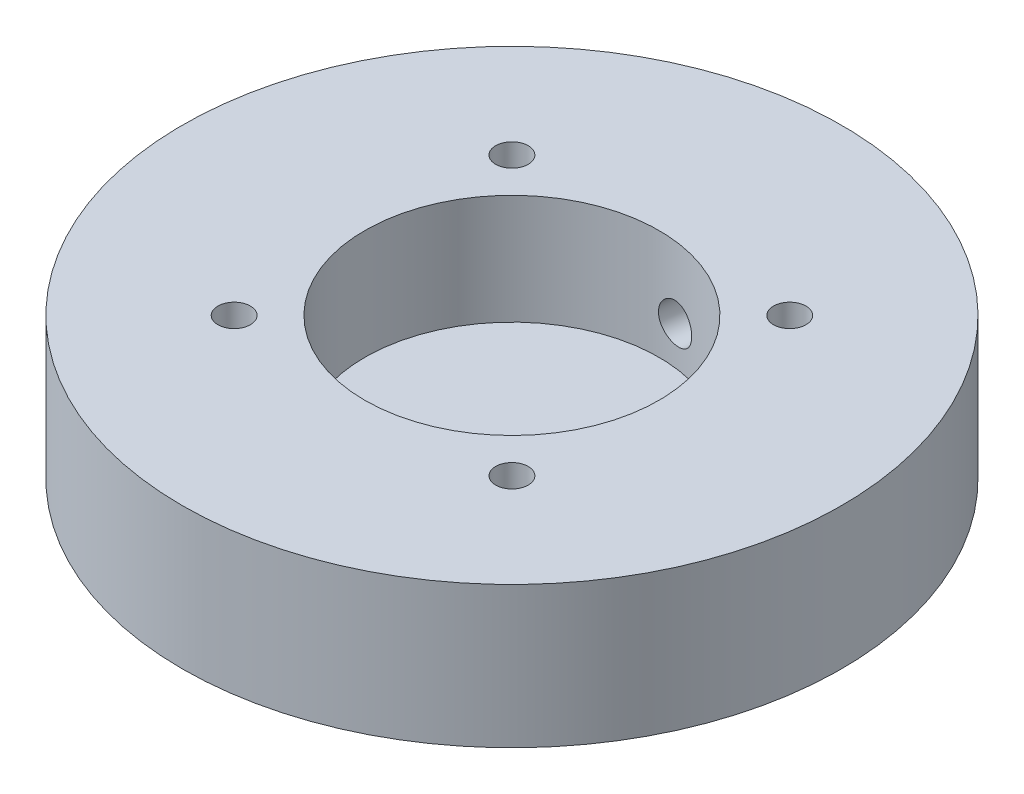
ISO-10303-21;
HEADER;
FILE_DESCRIPTION(('STEP AP214'),'2;1');
FILE_NAME('part.step','',(''),(''),'','','');
FILE_SCHEMA(('AUTOMOTIVE_DESIGN { 1 0 10303 214 1 1 1 1 }'));
ENDSEC;
DATA;
#1=APPLICATION_CONTEXT('core data for automotive mechanical design processes');
#2=APPLICATION_PROTOCOL_DEFINITION('international standard','automotive_design',2000,#1);
#3=PRODUCT_CONTEXT('',#1,'mechanical');
#4=PRODUCT('Part','Part','',(#3));
#5=PRODUCT_RELATED_PRODUCT_CATEGORY('part','',(#4));
#6=PRODUCT_DEFINITION_FORMATION('','',#4);
#7=PRODUCT_DEFINITION_CONTEXT('part definition',#1,'design');
#8=PRODUCT_DEFINITION('design','',#6,#7);
#9=PRODUCT_DEFINITION_SHAPE('','',#8);
#10=(LENGTH_UNIT() NAMED_UNIT(*) SI_UNIT(.MILLI.,.METRE.));
#11=(NAMED_UNIT(*) PLANE_ANGLE_UNIT() SI_UNIT($,.RADIAN.));
#12=(NAMED_UNIT(*) SI_UNIT($,.STERADIAN.) SOLID_ANGLE_UNIT());
#13=UNCERTAINTY_MEASURE_WITH_UNIT(LENGTH_MEASURE(1.E-05),#10,'distance_accuracy_value','');
#14=(GEOMETRIC_REPRESENTATION_CONTEXT(3) GLOBAL_UNCERTAINTY_ASSIGNED_CONTEXT((#13)) GLOBAL_UNIT_ASSIGNED_CONTEXT((#10,
#11,#12)) REPRESENTATION_CONTEXT('',''));
#15=CARTESIAN_POINT('',(0.,0.,0.));
#16=DIRECTION('',(0.,0.,1.));
#17=DIRECTION('',(1.,0.,0.));
#18=AXIS2_PLACEMENT_3D('',#15,#16,#17);
#19=CARTESIAN_POINT('',(0.,14.224,0.));
#20=DIRECTION('',(0.,-1.,0.));
#21=DIRECTION('',(0.,0.,-1.));
#22=AXIS2_PLACEMENT_3D('',#19,#20,#21);
#23=CYLINDRICAL_SURFACE('',#22,33.147);
#24=CARTESIAN_POINT('',(2.27775997149692,7.112,-33.068647062017));
#25=CARTESIAN_POINT('',(2.27776480074502,7.00366727545182,-33.0686472050766));
#26=CARTESIAN_POINT('',(2.28690433697704,6.8952583403161,-33.0680211355778));
#27=CARTESIAN_POINT('',(2.32322753381271,6.68143288111163,-33.0654886776516));
#28=CARTESIAN_POINT('',(2.35043229140885,6.57602000618265,-33.0635807922586));
#29=CARTESIAN_POINT('',(2.42208607091562,6.37131497335318,-33.0584087761803));
#30=CARTESIAN_POINT('',(2.46652610448374,6.27201965632218,-33.055145352357));
#31=CARTESIAN_POINT('',(2.57134912959211,6.08233356839173,-33.0471560382422));
#32=CARTESIAN_POINT('',(2.63172842930428,5.99194074215952,-33.0424304865629));
#33=CARTESIAN_POINT('',(2.76677243035728,5.82247961359012,-33.0313965892363));
#34=CARTESIAN_POINT('',(2.84145368720657,5.74342462289964,-33.0250864066072));
#35=CARTESIAN_POINT('',(3.00291337397992,5.59899703406418,-33.0107963365202));
#36=CARTESIAN_POINT('',(3.08969230426446,5.53362500212704,-33.0028163799936));
#37=CARTESIAN_POINT('',(3.27292405840319,5.41837956833296,-32.9851488031189));
#38=CARTESIAN_POINT('',(3.36938355301096,5.36851695216246,-32.9754600016967));
#39=CARTESIAN_POINT('',(3.56916292125147,5.28577487803292,-32.9544346503275));
#40=CARTESIAN_POINT('',(3.6724827293208,5.25289525779525,-32.9430981161265));
#41=CARTESIAN_POINT('',(3.88290470777343,5.20508881600628,-32.9189589175244));
#42=CARTESIAN_POINT('',(3.99000240995785,5.19014147298057,-32.9061579474249));
#43=CARTESIAN_POINT('',(4.20503583510082,5.17856052714615,-32.8793707360335));
#44=CARTESIAN_POINT('',(4.3129715496454,5.18192674069889,-32.8653845066281));
#45=CARTESIAN_POINT('',(4.52648147105514,5.20686039042291,-32.8366588885593));
#46=CARTESIAN_POINT('',(4.63205838319328,5.22840574722303,-32.8219204338985));
#47=CARTESIAN_POINT('',(4.83800674214259,5.28905183986952,-32.7921962066795));
#48=CARTESIAN_POINT('',(4.93837816143371,5.32815266851644,-32.7772104328143));
#49=CARTESIAN_POINT('',(5.13115939007857,5.42282484119506,-32.7475852518409));
#50=CARTESIAN_POINT('',(5.22356430883421,5.47840621092238,-32.7329460614422));
#51=CARTESIAN_POINT('',(5.39776664458206,5.60445441164681,-32.7046712911476));
#52=CARTESIAN_POINT('',(5.47956395845607,5.67492138733177,-32.6910357210086));
#53=CARTESIAN_POINT('',(5.63038997642598,5.82886524468858,-32.6653974712909));
#54=CARTESIAN_POINT('',(5.69939954217601,5.91236128730961,-32.6533972461842));
#55=CARTESIAN_POINT('',(5.82257798103855,6.08992593577095,-32.631658241011));
#56=CARTESIAN_POINT('',(5.8767468490338,6.1839945452568,-32.6219194617242));
#57=CARTESIAN_POINT('',(5.96873471399433,6.380046103969,-32.6052144822183));
#58=CARTESIAN_POINT('',(6.00655294048117,6.48202942588709,-32.5982484126567));
#59=CARTESIAN_POINT('',(6.06477574220388,6.6910099882529,-32.5874667391462));
#60=CARTESIAN_POINT('',(6.08518049519745,6.79800717750703,-32.5836511030375));
#61=CARTESIAN_POINT('',(6.10798639940271,7.01380999252541,-32.579383794611));
#62=CARTESIAN_POINT('',(6.11041394489487,7.12261273186276,-32.578927190542));
#63=CARTESIAN_POINT('',(6.097267010735,7.33908601302002,-32.5813901943875));
#64=CARTESIAN_POINT('',(6.08169261224396,7.44675655994216,-32.5843097870807));
#65=CARTESIAN_POINT('',(6.03299592891584,7.65783346596626,-32.5933609104833));
#66=CARTESIAN_POINT('',(5.99988577838945,7.76124272051229,-32.5994902201143));
#67=CARTESIAN_POINT('',(5.91704963240439,7.96095093906233,-32.6146270125059));
#68=CARTESIAN_POINT('',(5.86732350615068,8.05724984708893,-32.6236345179225));
#69=CARTESIAN_POINT('',(5.75257122562748,8.24012700492737,-32.6440640963001));
#70=CARTESIAN_POINT('',(5.68752730504514,8.32669379340173,-32.6554889714683));
#71=CARTESIAN_POINT('',(5.54397852332861,8.48753400251554,-32.6801652522115));
#72=CARTESIAN_POINT('',(5.46547354715983,8.56180731808759,-32.6934166733955));
#73=CARTESIAN_POINT('',(5.29708317802606,8.69604261142275,-32.7211215326807));
#74=CARTESIAN_POINT('',(5.2071841994641,8.75598725406324,-32.7355763985265));
#75=CARTESIAN_POINT('',(5.01859393384549,8.85974501406645,-32.765018236732));
#76=CARTESIAN_POINT('',(4.91990269520957,8.9035582202614,-32.7800052061611));
#77=CARTESIAN_POINT('',(4.71656746984873,8.97377919908646,-32.8098787606006));
#78=CARTESIAN_POINT('',(4.61192729584479,9.00019798632201,-32.8247654032174));
#79=CARTESIAN_POINT('',(4.39959651859217,9.03491625007255,-32.8538983662474));
#80=CARTESIAN_POINT('',(4.29190594067574,9.04321587701447,-32.8681446919756));
#81=CARTESIAN_POINT('',(4.07669645785202,9.04145878881732,-32.8955301591105));
#82=CARTESIAN_POINT('',(3.969177534771,9.03142922498919,-32.9086709080671));
#83=CARTESIAN_POINT('',(3.75721075206288,8.99335469229027,-32.9335447293307));
#84=CARTESIAN_POINT('',(3.65276289799003,8.96530969083941,-32.9452777990919));
#85=CARTESIAN_POINT('',(3.44991555650444,8.89200631956031,-32.9671367733696));
#86=CARTESIAN_POINT('',(3.35151606216838,8.84674796943593,-32.9772626797257));
#87=CARTESIAN_POINT('',(3.16357336704854,8.740306659403,-32.9958230881444));
#88=CARTESIAN_POINT('',(3.07402992126095,8.67912414020893,-33.0042576370053));
#89=CARTESIAN_POINT('',(2.9062362020646,8.54247175911382,-33.0194566870518));
#90=CARTESIAN_POINT('',(2.8280015450879,8.46698246687298,-33.0262188878571));
#91=CARTESIAN_POINT('',(2.68519897270119,8.30388177641458,-33.0381365245683));
#92=CARTESIAN_POINT('',(2.6206344131234,8.21626741035694,-33.0432915660837));
#93=CARTESIAN_POINT('',(2.50699614174407,8.03131496961986,-33.0521079782249));
#94=CARTESIAN_POINT('',(2.4579401327657,7.93396594853475,-33.0557676432798));
#95=CARTESIAN_POINT('',(2.37689078568836,7.7324582907586,-33.0616948462154));
#96=CARTESIAN_POINT('',(2.34487740107104,7.62830781701768,-33.063964020149));
#97=CARTESIAN_POINT('',(2.30719060641697,7.45493040712774,-33.0666097545669));
#98=CARTESIAN_POINT('',(2.29616857989923,7.38682504526189,-33.0673747692324));
#99=CARTESIAN_POINT('',(2.28145173049005,7.24982340547063,-33.0683933771417));
#100=CARTESIAN_POINT('',(2.27775689886853,7.18092712848767,-33.0686469709948));
#101=CARTESIAN_POINT('',(2.27775997149692,7.112,-33.068647062017));
#102=B_SPLINE_CURVE_WITH_KNOTS('',3,(#24,#25,#26,#27,#28,#29,#30,#31,#32,#33,#34,#35,#36,#37,
#38,#39,#40,#41,#42,#43,#44,#45,#46,#47,#48,#49,#50,#51,#52,#53,#54,#55,#56,#57,#58,#59,#60,#61,
#62,#63,#64,#65,#66,#67,#68,#69,#70,#71,#72,#73,#74,#75,#76,#77,#78,#79,#80,#81,#82,#83,#84,#85,
#86,#87,#88,#89,#90,#91,#92,#93,#94,#95,#96,#97,#98,#99,#100,#101),.UNSPECIFIED.,.T.,.F.,(4,2,2,
2,2,2,2,2,2,2,2,2,2,2,2,2,2,2,2,2,2,2,2,2,2,2,2,2,2,2,2,2,2,2,2,2,2,2,4),(0.,0.32474655272017,
0.649873020672908,0.974830159921774,1.29971209903933,1.62497240994329,1.95024617762559,
2.27574564673619,2.60124200552449,2.92636551392941,3.25148576217581,3.57621170499482,
3.90093936437864,4.22586497378495,4.55079374160805,4.87620494321775,5.20161625703328,
5.52704290327955,5.85246622751255,6.17741166770357,6.50235564289791,6.82707505804438,
7.15179702932669,7.47689749994506,7.80200074892385,8.127495346024,8.45298815067125,
8.77827464594397,9.10355844064808,9.42836077799917,9.75316370274138,10.0779662556874,
10.4027598204108,10.7279976970585,11.0533153230654,11.3790029654882,11.7043066640902,
11.9109282009174,12.1175494915628),.UNSPECIFIED.);
#103=CARTESIAN_POINT('',(2.27775997149692,7.112,-33.068647062017));
#104=VERTEX_POINT('',#103);
#105=EDGE_CURVE('E11',#104,#104,#102,.T.);
#106=ORIENTED_EDGE('',*,*,#105,.T.);
#107=EDGE_LOOP('',(#106));
#108=FACE_BOUND('',#107,.T.);
#109=CARTESIAN_POINT('',(0.,14.224,0.));
#110=DIRECTION('',(0.,1.,0.));
#111=DIRECTION('',(0.,0.,1.));
#112=AXIS2_PLACEMENT_3D('',#109,#110,#111);
#113=CIRCLE('',#112,33.147);
#114=CARTESIAN_POINT('',(0.,14.224,33.147));
#115=VERTEX_POINT('',#114);
#116=EDGE_CURVE('E45',#115,#115,#113,.T.);
#117=ORIENTED_EDGE('',*,*,#116,.F.);
#118=EDGE_LOOP('',(#117));
#119=FACE_BOUND('',#118,.T.);
#120=CARTESIAN_POINT('',(0.,0.,0.));
#121=DIRECTION('',(0.,1.,0.));
#122=DIRECTION('',(0.,0.,1.));
#123=AXIS2_PLACEMENT_3D('',#120,#121,#122);
#124=CIRCLE('',#123,33.147);
#125=CARTESIAN_POINT('',(0.,0.,33.147));
#126=VERTEX_POINT('',#125);
#127=EDGE_CURVE('E49',#126,#126,#124,.T.);
#128=ORIENTED_EDGE('',*,*,#127,.T.);
#129=EDGE_LOOP('',(#128));
#130=FACE_BOUND('',#129,.T.);
#131=ADVANCED_FACE('F35',(#108,#119,#130),#23,.T.);
#132=CARTESIAN_POINT('',(0.,14.224,0.));
#133=DIRECTION('',(0.,1.,0.));
#134=DIRECTION('',(0.,0.,1.));
#135=AXIS2_PLACEMENT_3D('',#132,#133,#134);
#136=PLANE('',#135);
#137=CARTESIAN_POINT('',(-13.97,14.224,13.97));
#138=DIRECTION('',(0.,-1.,0.));
#139=DIRECTION('',(0.,0.,-1.));
#140=AXIS2_PLACEMENT_3D('',#137,#138,#139);
#141=CIRCLE('',#140,1.63195);
#142=CARTESIAN_POINT('',(-13.97,14.224,12.33805));
#143=VERTEX_POINT('',#142);
#144=EDGE_CURVE('E199',#143,#143,#141,.T.);
#145=ORIENTED_EDGE('',*,*,#144,.T.);
#146=EDGE_LOOP('',(#145));
#147=FACE_BOUND('',#146,.T.);
#148=CARTESIAN_POINT('',(13.97,14.224,13.97));
#149=DIRECTION('',(0.,-1.,0.));
#150=DIRECTION('',(0.,0.,-1.));
#151=AXIS2_PLACEMENT_3D('',#148,#149,#150);
#152=CIRCLE('',#151,1.63195);
#153=CARTESIAN_POINT('',(13.97,14.224,12.33805));
#154=VERTEX_POINT('',#153);
#155=EDGE_CURVE('E209',#154,#154,#152,.T.);
#156=ORIENTED_EDGE('',*,*,#155,.T.);
#157=EDGE_LOOP('',(#156));
#158=FACE_BOUND('',#157,.T.);
#159=CARTESIAN_POINT('',(13.97,14.224,-13.97));
#160=DIRECTION('',(0.,-1.,0.));
#161=DIRECTION('',(0.,0.,-1.));
#162=AXIS2_PLACEMENT_3D('',#159,#160,#161);
#163=CIRCLE('',#162,1.63195);
#164=CARTESIAN_POINT('',(13.97,14.224,-15.60195));
#165=VERTEX_POINT('',#164);
#166=EDGE_CURVE('E121',#165,#165,#163,.T.);
#167=ORIENTED_EDGE('',*,*,#166,.T.);
#168=EDGE_LOOP('',(#167));
#169=FACE_BOUND('',#168,.T.);
#170=CARTESIAN_POINT('',(-13.97,14.224,-13.97));
#171=DIRECTION('',(0.,-1.,0.));
#172=DIRECTION('',(0.,0.,-1.));
#173=AXIS2_PLACEMENT_3D('',#170,#171,#172);
#174=CIRCLE('',#173,1.63195);
#175=CARTESIAN_POINT('',(-13.97,14.224,-15.60195));
#176=VERTEX_POINT('',#175);
#177=EDGE_CURVE('E67',#176,#176,#174,.T.);
#178=ORIENTED_EDGE('',*,*,#177,.T.);
#179=EDGE_LOOP('',(#178));
#180=FACE_BOUND('',#179,.T.);
#181=CARTESIAN_POINT('',(0.,14.224,0.));
#182=DIRECTION('',(0.,1.,0.));
#183=DIRECTION('',(0.,0.,1.));
#184=AXIS2_PLACEMENT_3D('',#181,#182,#183);
#185=CIRCLE('',#184,14.7955);
#186=CARTESIAN_POINT('',(0.,14.224,14.7955));
#187=VERTEX_POINT('',#186);
#188=EDGE_CURVE('E58',#187,#187,#185,.T.);
#189=ORIENTED_EDGE('',*,*,#188,.F.);
#190=EDGE_LOOP('',(#189));
#191=FACE_BOUND('',#190,.T.);
#192=ORIENTED_EDGE('',*,*,#116,.T.);
#193=EDGE_LOOP('',(#192));
#194=FACE_BOUND('',#193,.T.);
#195=ADVANCED_FACE('F91',(#147,#158,#169,#180,#191,#194),#136,.T.);
#196=CARTESIAN_POINT('',(0.,0.,0.));
#197=DIRECTION('',(0.,1.,0.));
#198=DIRECTION('',(0.,0.,1.));
#199=AXIS2_PLACEMENT_3D('',#196,#197,#198);
#200=PLANE('',#199);
#201=CARTESIAN_POINT('',(-13.97,0.,13.97));
#202=DIRECTION('',(0.,-1.,0.));
#203=DIRECTION('',(0.,0.,-1.));
#204=AXIS2_PLACEMENT_3D('',#201,#202,#203);
#205=CIRCLE('',#204,3.37311999999999);
#206=CARTESIAN_POINT('',(-13.97,0.,10.59688));
#207=VERTEX_POINT('',#206);
#208=EDGE_CURVE('E107',#207,#207,#205,.T.);
#209=ORIENTED_EDGE('',*,*,#208,.F.);
#210=EDGE_LOOP('',(#209));
#211=FACE_BOUND('',#210,.T.);
#212=CARTESIAN_POINT('',(13.97,0.,13.97));
#213=DIRECTION('',(0.,-1.,0.));
#214=DIRECTION('',(0.,0.,-1.));
#215=AXIS2_PLACEMENT_3D('',#212,#213,#214);
#216=CIRCLE('',#215,3.37312);
#217=CARTESIAN_POINT('',(13.97,0.,10.59688));
#218=VERTEX_POINT('',#217);
#219=EDGE_CURVE('E111',#218,#218,#216,.T.);
#220=ORIENTED_EDGE('',*,*,#219,.F.);
#221=EDGE_LOOP('',(#220));
#222=FACE_BOUND('',#221,.T.);
#223=CARTESIAN_POINT('',(13.97,0.,-13.97));
#224=DIRECTION('',(0.,-1.,0.));
#225=DIRECTION('',(0.,0.,-1.));
#226=AXIS2_PLACEMENT_3D('',#223,#224,#225);
#227=CIRCLE('',#226,3.37312);
#228=CARTESIAN_POINT('',(13.97,0.,-17.34312));
#229=VERTEX_POINT('',#228);
#230=EDGE_CURVE('E115',#229,#229,#227,.T.);
#231=ORIENTED_EDGE('',*,*,#230,.F.);
#232=EDGE_LOOP('',(#231));
#233=FACE_BOUND('',#232,.T.);
#234=CARTESIAN_POINT('',(-13.97,0.,-13.97));
#235=DIRECTION('',(0.,-1.,0.));
#236=DIRECTION('',(0.,0.,-1.));
#237=AXIS2_PLACEMENT_3D('',#234,#235,#236);
#238=CIRCLE('',#237,3.37311999999999);
#239=CARTESIAN_POINT('',(-13.97,0.,-17.34312));
#240=VERTEX_POINT('',#239);
#241=EDGE_CURVE('E118',#240,#240,#238,.T.);
#242=ORIENTED_EDGE('',*,*,#241,.F.);
#243=EDGE_LOOP('',(#242));
#244=FACE_BOUND('',#243,.T.);
#245=ORIENTED_EDGE('',*,*,#127,.F.);
#246=EDGE_LOOP('',(#245));
#247=FACE_BOUND('',#246,.T.);
#248=ADVANCED_FACE('F87',(#211,#222,#233,#244,#247),#200,.F.);
#249=CARTESIAN_POINT('',(0.,-41.8479935241823,0.));
#250=DIRECTION('',(0.,1.,0.));
#251=DIRECTION('',(0.,0.,1.));
#252=AXIS2_PLACEMENT_3D('',#249,#250,#251);
#253=CYLINDRICAL_SURFACE('',#252,14.7955);
#254=CARTESIAN_POINT('',(-0.0562745136089145,7.112,-14.7953929798812));
#255=CARTESIAN_POINT('',(-0.0562697819615434,7.21993514093656,-14.7953939977717));
#256=CARTESIAN_POINT('',(-0.0471120634199765,7.32793676661728,-14.7954366012239));
#257=CARTESIAN_POINT('',(-0.0107391683486774,7.54093149094708,-14.7955068498458));
#258=CARTESIAN_POINT('',(0.0164946216915659,7.64592137192748,-14.7955344795431));
#259=CARTESIAN_POINT('',(0.0881631599432632,7.84977811490317,-14.7952804426519));
#260=CARTESIAN_POINT('',(0.132585923594147,7.94864918748796,-14.7949989913113));
#261=CARTESIAN_POINT('',(0.2372882332115,8.13757001342096,-14.7936892883995));
#262=CARTESIAN_POINT('',(0.297565176468355,8.22762121136145,-14.7926611593582));
#263=CARTESIAN_POINT('',(0.432587047608249,8.39691162142801,-14.7893292861938));
#264=CARTESIAN_POINT('',(0.507408860275007,8.47608938320443,-14.7870186365597));
#265=CARTESIAN_POINT('',(0.669151645380042,8.62085418633251,-14.7805816445563));
#266=CARTESIAN_POINT('',(0.756073231883924,8.68644053749706,-14.7764552100125));
#267=CARTESIAN_POINT('',(0.939862847182169,8.80238260899526,-14.7659055932698));
#268=CARTESIAN_POINT('',(1.03676564764711,8.85268249575692,-14.7594741741269));
#269=CARTESIAN_POINT('',(1.23745764898174,8.93626605622904,-14.7440034073456));
#270=CARTESIAN_POINT('',(1.34124657215167,8.96955041566169,-14.7349641648249));
#271=CARTESIAN_POINT('',(1.55209288084541,9.01797389483695,-14.7142441138115));
#272=CARTESIAN_POINT('',(1.65912826327229,9.0332153640676,-14.702578656398));
#273=CARTESIAN_POINT('',(1.87393492530874,9.0454377331804,-14.6767464806064));
#274=CARTESIAN_POINT('',(1.98170617333198,9.04241941198574,-14.662579868947));
#275=CARTESIAN_POINT('',(2.19423972513728,9.01828964736664,-14.6322790182467));
#276=CARTESIAN_POINT('',(2.2990163359817,8.99728828537563,-14.6161572617813));
#277=CARTESIAN_POINT('',(2.50331380499446,8.93796081580922,-14.5825568574868));
#278=CARTESIAN_POINT('',(2.60283455572177,8.89963435422469,-14.5650781819375));
#279=CARTESIAN_POINT('',(2.79417899323033,8.80662846441027,-14.5295867223818));
#280=CARTESIAN_POINT('',(2.88597938189007,8.7519016626896,-14.5115725291585));
#281=CARTESIAN_POINT('',(3.05909502195199,8.62768307126885,-14.4760691710285));
#282=CARTESIAN_POINT('',(3.14040974934725,8.5581905441305,-14.458580032394));
#283=CARTESIAN_POINT('',(3.29095445077352,8.4057972537024,-14.4250630211908));
#284=CARTESIAN_POINT('',(3.36008994419643,8.32280051559719,-14.4090469974607));
#285=CARTESIAN_POINT('',(3.48366156807495,8.1460837275787,-14.3796720822086));
#286=CARTESIAN_POINT('',(3.53809764469905,8.05236363839668,-14.3663132004176));
#287=CARTESIAN_POINT('',(3.63080039959159,7.85677274799832,-14.3431657541447));
#288=CARTESIAN_POINT('',(3.66905916936021,7.75489798913413,-14.3333789362346));
#289=CARTESIAN_POINT('',(3.72828925775445,7.545935675484,-14.3180872962));
#290=CARTESIAN_POINT('',(3.74926148689056,7.43884839556481,-14.3125822485485));
#291=CARTESIAN_POINT('',(3.77322984370758,7.22334309787621,-14.3062822493854));
#292=CARTESIAN_POINT('',(3.77635688331046,7.1149406330915,-14.3054529968808));
#293=CARTESIAN_POINT('',(3.76489648082726,6.89914428445029,-14.3084733104777));
#294=CARTESIAN_POINT('',(3.75030945102386,6.79175037717895,-14.3123227676854));
#295=CARTESIAN_POINT('',(3.70392417726946,6.58142459542823,-14.324396354386));
#296=CARTESIAN_POINT('',(3.67218975700001,6.47847769382844,-14.3326042595129));
#297=CARTESIAN_POINT('',(3.5924325766579,6.27949733170431,-14.3528021933045));
#298=CARTESIAN_POINT('',(3.54440919610793,6.18346413470501,-14.3647923660419));
#299=CARTESIAN_POINT('',(3.43305476311429,6.00043116951265,-14.3918117043948));
#300=CARTESIAN_POINT('',(3.36963739922956,5.9134864362636,-14.4068579242204));
#301=CARTESIAN_POINT('',(3.22934190997285,5.75166083454464,-14.4389520502424));
#302=CARTESIAN_POINT('',(3.15246321313,5.67678047850019,-14.4560000414094));
#303=CARTESIAN_POINT('',(2.98677510100657,5.54073563203726,-14.4911420286862));
#304=CARTESIAN_POINT('',(2.89789435332306,5.47965948164825,-14.5092418788064));
#305=CARTESIAN_POINT('',(2.7109910967245,5.37356888479205,-14.5453220486149));
#306=CARTESIAN_POINT('',(2.61296878608897,5.32855409005793,-14.5633023708865));
#307=CARTESIAN_POINT('',(2.41079282678689,5.25600893065242,-14.5981293566199));
#308=CARTESIAN_POINT('',(2.30665784710115,5.22842807589707,-14.6149791662666));
#309=CARTESIAN_POINT('',(2.094941647608,5.19136962405516,-14.6468253387445));
#310=CARTESIAN_POINT('',(1.98736059809414,5.18189113380764,-14.661821792985));
#311=CARTESIAN_POINT('',(1.77264714152934,5.18132420071447,-14.689321684259));
#312=CARTESIAN_POINT('',(1.66551733269725,5.1900997600784,-14.701842801977));
#313=CARTESIAN_POINT('',(1.45397011310247,5.2255030768171,-14.724269395797));
#314=CARTESIAN_POINT('',(1.34955269923458,5.25213081375341,-14.7341748748936));
#315=CARTESIAN_POINT('',(1.14645196600018,5.32243874992721,-14.7513680521959));
#316=CARTESIAN_POINT('',(1.04776627344204,5.36611183295838,-14.7586568404006));
#317=CARTESIAN_POINT('',(0.858871253909876,5.4692566176083,-14.7708540655474));
#318=CARTESIAN_POINT('',(0.768662064053445,5.52872857473324,-14.7757624639891));
#319=CARTESIAN_POINT('',(0.598654176691276,5.66228391079916,-14.7836307611483));
#320=CARTESIAN_POINT('',(0.518934219468212,5.73646836051249,-14.7865765300436));
#321=CARTESIAN_POINT('',(0.372938282990145,5.89713190723087,-14.7909799012628));
#322=CARTESIAN_POINT('',(0.30666548486868,5.98361390520072,-14.7924371517827));
#323=CARTESIAN_POINT('',(0.189277711930316,6.16683763956468,-14.7944065713981));
#324=CARTESIAN_POINT('',(0.138227666656789,6.26362100054258,-14.7949147394979));
#325=CARTESIAN_POINT('',(0.0532526547782159,6.46435438523614,-14.7954657302914));
#326=CARTESIAN_POINT('',(0.0193092355385098,6.56829654865757,-14.7955090554318));
#327=CARTESIAN_POINT('',(-0.0224002945384891,6.74596912269093,-14.7954921166919));
#328=CARTESIAN_POINT('',(-0.0350838777029044,6.81858319071257,-14.795460854368));
#329=CARTESIAN_POINT('',(-0.0520225648546932,6.9647878674496,-14.7954109388699));
#330=CARTESIAN_POINT('',(-0.0562777410205461,7.03837846779681,-14.7953922855878));
#331=CARTESIAN_POINT('',(-0.0562745136089145,7.112,-14.7953929798812));
#332=B_SPLINE_CURVE_WITH_KNOTS('',3,(#254,#255,#256,#257,#258,#259,#260,#261,#262,#263,#264,
#265,#266,#267,#268,#269,#270,#271,#272,#273,#274,#275,#276,#277,#278,#279,#280,#281,#282,#283,
#284,#285,#286,#287,#288,#289,#290,#291,#292,#293,#294,#295,#296,#297,#298,#299,#300,#301,#302,
#303,#304,#305,#306,#307,#308,#309,#310,#311,#312,#313,#314,#315,#316,#317,#318,#319,#320,#321,
#322,#323,#324,#325,#326,#327,#328,#329,#330,#331),.UNSPECIFIED.,.T.,.F.,(4,2,2,2,2,2,2,2,2,2,2,
2,2,2,2,2,2,2,2,2,2,2,2,2,2,2,2,2,2,2,2,2,2,2,2,2,2,2,4),(0.,0.323536443319418,0.64740656042763,
0.971051273305395,1.29464288800712,1.61999396862311,1.94536156688625,2.27190366483278,
2.59843260216363,2.92310026884912,3.24775408601135,3.57043465846491,3.8931218246488,
4.21675022933745,4.54039480066069,4.86644896678422,5.19250432695165,5.51871890001228,
5.84491628971729,6.1687175954976,6.49251136517147,6.81510817303851,7.13771727060865,
7.46217874910499,7.78665400523055,8.11315038475886,8.43963968426204,8.76517905948018,
9.09070237234489,9.41380913404405,9.7369155258277,10.0598871690135,10.3828640357537,
10.7081417260308,11.0334962762935,11.3602193370225,11.6865892085923,11.9072722267267,
12.1279533549864),.UNSPECIFIED.);
#333=CARTESIAN_POINT('',(-0.0562745136089145,7.112,-14.7953929798812));
#334=VERTEX_POINT('',#333);
#335=EDGE_CURVE('E61',#334,#334,#332,.T.);
#336=ORIENTED_EDGE('',*,*,#335,.T.);
#337=EDGE_LOOP('',(#336));
#338=FACE_BOUND('',#337,.T.);
#339=CARTESIAN_POINT('',(0.,3.175,0.));
#340=DIRECTION('',(0.,1.,0.));
#341=DIRECTION('',(0.,0.,1.));
#342=AXIS2_PLACEMENT_3D('',#339,#340,#341);
#343=CIRCLE('',#342,14.7955);
#344=CARTESIAN_POINT('',(0.,3.175,14.7955));
#345=VERTEX_POINT('',#344);
#346=EDGE_CURVE('E54',#345,#345,#343,.F.);
#347=ORIENTED_EDGE('',*,*,#346,.T.);
#348=EDGE_LOOP('',(#347));
#349=FACE_BOUND('',#348,.T.);
#350=ORIENTED_EDGE('',*,*,#188,.T.);
#351=EDGE_LOOP('',(#350));
#352=FACE_BOUND('',#351,.T.);
#353=ADVANCED_FACE('F69',(#338,#349,#352),#253,.F.);
#354=CARTESIAN_POINT('',(0.,3.175,0.));
#355=DIRECTION('',(0.,1.,0.));
#356=DIRECTION('',(0.,0.,1.));
#357=AXIS2_PLACEMENT_3D('',#354,#355,#356);
#358=PLANE('',#357);
#359=ORIENTED_EDGE('',*,*,#346,.F.);
#360=EDGE_LOOP('',(#359));
#361=FACE_BOUND('',#360,.T.);
#362=ADVANCED_FACE('F78',(#361),#358,.T.);
#363=CARTESIAN_POINT('',(4.19973096880096,7.112,-32.8798702672272));
#364=DIRECTION('',(0.126700183087488,0.,-0.991941058534023));
#365=DIRECTION('',(-0.991941058534023,0.,-0.126700183087488));
#366=AXIS2_PLACEMENT_3D('',#363,#364,#365);
#367=CYLINDRICAL_SURFACE('',#366,1.9304);
#368=ORIENTED_EDGE('',*,*,#105,.F.);
#369=EDGE_LOOP('',(#368));
#370=FACE_BOUND('',#369,.T.);
#371=ORIENTED_EDGE('',*,*,#335,.F.);
#372=EDGE_LOOP('',(#371));
#373=FACE_BOUND('',#372,.T.);
#374=ADVANCED_FACE('F73',(#370,#373),#367,.F.);
#375=CARTESIAN_POINT('',(-13.97,0.,-13.97));
#376=DIRECTION('',(0.,-1.,0.));
#377=DIRECTION('',(0.,0.,-1.));
#378=AXIS2_PLACEMENT_3D('',#375,#376,#377);
#379=CYLINDRICAL_SURFACE('',#378,1.63195);
#380=ORIENTED_EDGE('',*,*,#177,.F.);
#381=EDGE_LOOP('',(#380));
#382=FACE_BOUND('',#381,.T.);
#383=CARTESIAN_POINT('',(-13.97,11.049,-13.97));
#384=DIRECTION('',(0.,-1.,0.));
#385=DIRECTION('',(0.,0.,-1.));
#386=AXIS2_PLACEMENT_3D('',#383,#384,#385);
#387=CIRCLE('',#386,1.63195);
#388=CARTESIAN_POINT('',(-13.97,11.049,-15.60195));
#389=VERTEX_POINT('',#388);
#390=EDGE_CURVE('E124',#389,#389,#387,.T.);
#391=ORIENTED_EDGE('',*,*,#390,.T.);
#392=EDGE_LOOP('',(#391));
#393=FACE_BOUND('',#392,.T.);
#394=ADVANCED_FACE('F77',(#382,#393),#379,.F.);
#395=CARTESIAN_POINT('',(-12.33805,11.049,-13.97));
#396=DIRECTION('',(0.,1.,0.));
#397=DIRECTION('',(0.,0.,1.));
#398=AXIS2_PLACEMENT_3D('',#395,#396,#397);
#399=PLANE('',#398);
#400=ORIENTED_EDGE('',*,*,#390,.F.);
#401=EDGE_LOOP('',(#400));
#402=FACE_BOUND('',#401,.T.);
#403=CARTESIAN_POINT('',(-13.97,11.049,-13.97));
#404=DIRECTION('',(0.,-1.,0.));
#405=DIRECTION('',(0.,0.,-1.));
#406=AXIS2_PLACEMENT_3D('',#403,#404,#405);
#407=CIRCLE('',#406,3.37312);
#408=CARTESIAN_POINT('',(-13.97,11.049,-17.34312));
#409=VERTEX_POINT('',#408);
#410=EDGE_CURVE('E120',#409,#409,#407,.T.);
#411=ORIENTED_EDGE('',*,*,#410,.T.);
#412=EDGE_LOOP('',(#411));
#413=FACE_BOUND('',#412,.T.);
#414=ADVANCED_FACE('F139',(#402,#413),#399,.F.);
#415=CARTESIAN_POINT('',(-13.97,0.,-13.97));
#416=DIRECTION('',(0.,-1.,0.));
#417=DIRECTION('',(0.,0.,-1.));
#418=AXIS2_PLACEMENT_3D('',#415,#416,#417);
#419=CYLINDRICAL_SURFACE('',#418,3.37312);
#420=ORIENTED_EDGE('',*,*,#410,.F.);
#421=EDGE_LOOP('',(#420));
#422=FACE_BOUND('',#421,.T.);
#423=ORIENTED_EDGE('',*,*,#241,.T.);
#424=EDGE_LOOP('',(#423));
#425=FACE_BOUND('',#424,.T.);
#426=ADVANCED_FACE('F143',(#422,#425),#419,.F.);
#427=CARTESIAN_POINT('',(13.97,0.,-13.97));
#428=DIRECTION('',(0.,-1.,0.));
#429=DIRECTION('',(0.,0.,-1.));
#430=AXIS2_PLACEMENT_3D('',#427,#428,#429);
#431=CYLINDRICAL_SURFACE('',#430,1.63195);
#432=ORIENTED_EDGE('',*,*,#166,.F.);
#433=EDGE_LOOP('',(#432));
#434=FACE_BOUND('',#433,.T.);
#435=CARTESIAN_POINT('',(13.97,11.049,-13.97));
#436=DIRECTION('',(0.,-1.,0.));
#437=DIRECTION('',(0.,0.,-1.));
#438=AXIS2_PLACEMENT_3D('',#435,#436,#437);
#439=CIRCLE('',#438,1.63195);
#440=CARTESIAN_POINT('',(13.97,11.049,-15.60195));
#441=VERTEX_POINT('',#440);
#442=EDGE_CURVE('E127',#441,#441,#439,.T.);
#443=ORIENTED_EDGE('',*,*,#442,.T.);
#444=EDGE_LOOP('',(#443));
#445=FACE_BOUND('',#444,.T.);
#446=ADVANCED_FACE('F148',(#434,#445),#431,.F.);
#447=CARTESIAN_POINT('',(15.60195,11.049,-13.97));
#448=DIRECTION('',(0.,1.,0.));
#449=DIRECTION('',(0.,0.,1.));
#450=AXIS2_PLACEMENT_3D('',#447,#448,#449);
#451=PLANE('',#450);
#452=ORIENTED_EDGE('',*,*,#442,.F.);
#453=EDGE_LOOP('',(#452));
#454=FACE_BOUND('',#453,.T.);
#455=CARTESIAN_POINT('',(13.97,11.049,-13.97));
#456=DIRECTION('',(0.,-1.,0.));
#457=DIRECTION('',(0.,0.,-1.));
#458=AXIS2_PLACEMENT_3D('',#455,#456,#457);
#459=CIRCLE('',#458,3.37312);
#460=CARTESIAN_POINT('',(13.97,11.049,-17.34312));
#461=VERTEX_POINT('',#460);
#462=EDGE_CURVE('E213',#461,#461,#459,.T.);
#463=ORIENTED_EDGE('',*,*,#462,.T.);
#464=EDGE_LOOP('',(#463));
#465=FACE_BOUND('',#464,.T.);
#466=ADVANCED_FACE('F155',(#454,#465),#451,.F.);
#467=CARTESIAN_POINT('',(13.97,0.,-13.97));
#468=DIRECTION('',(0.,-1.,0.));
#469=DIRECTION('',(0.,0.,-1.));
#470=AXIS2_PLACEMENT_3D('',#467,#468,#469);
#471=CYLINDRICAL_SURFACE('',#470,3.37312);
#472=ORIENTED_EDGE('',*,*,#462,.F.);
#473=EDGE_LOOP('',(#472));
#474=FACE_BOUND('',#473,.T.);
#475=ORIENTED_EDGE('',*,*,#230,.T.);
#476=EDGE_LOOP('',(#475));
#477=FACE_BOUND('',#476,.T.);
#478=ADVANCED_FACE('F159',(#474,#477),#471,.F.);
#479=CARTESIAN_POINT('',(13.97,0.,13.97));
#480=DIRECTION('',(0.,-1.,0.));
#481=DIRECTION('',(0.,0.,-1.));
#482=AXIS2_PLACEMENT_3D('',#479,#480,#481);
#483=CYLINDRICAL_SURFACE('',#482,1.63195);
#484=ORIENTED_EDGE('',*,*,#155,.F.);
#485=EDGE_LOOP('',(#484));
#486=FACE_BOUND('',#485,.T.);
#487=CARTESIAN_POINT('',(13.97,11.049,13.97));
#488=DIRECTION('',(0.,-1.,0.));
#489=DIRECTION('',(0.,0.,-1.));
#490=AXIS2_PLACEMENT_3D('',#487,#488,#489);
#491=CIRCLE('',#490,1.63195);
#492=CARTESIAN_POINT('',(13.97,11.049,12.33805));
#493=VERTEX_POINT('',#492);
#494=EDGE_CURVE('E206',#493,#493,#491,.T.);
#495=ORIENTED_EDGE('',*,*,#494,.T.);
#496=EDGE_LOOP('',(#495));
#497=FACE_BOUND('',#496,.T.);
#498=ADVANCED_FACE('F163',(#486,#497),#483,.F.);
#499=CARTESIAN_POINT('',(15.60195,11.049,13.97));
#500=DIRECTION('',(0.,1.,0.));
#501=DIRECTION('',(0.,0.,1.));
#502=AXIS2_PLACEMENT_3D('',#499,#500,#501);
#503=PLANE('',#502);
#504=ORIENTED_EDGE('',*,*,#494,.F.);
#505=EDGE_LOOP('',(#504));
#506=FACE_BOUND('',#505,.T.);
#507=CARTESIAN_POINT('',(13.97,11.049,13.97));
#508=DIRECTION('',(0.,-1.,0.));
#509=DIRECTION('',(0.,0.,-1.));
#510=AXIS2_PLACEMENT_3D('',#507,#508,#509);
#511=CIRCLE('',#510,3.37312);
#512=CARTESIAN_POINT('',(13.97,11.049,10.59688));
#513=VERTEX_POINT('',#512);
#514=EDGE_CURVE('E203',#513,#513,#511,.T.);
#515=ORIENTED_EDGE('',*,*,#514,.T.);
#516=EDGE_LOOP('',(#515));
#517=FACE_BOUND('',#516,.T.);
#518=ADVANCED_FACE('F167',(#506,#517),#503,.F.);
#519=CARTESIAN_POINT('',(13.97,0.,13.97));
#520=DIRECTION('',(0.,-1.,0.));
#521=DIRECTION('',(0.,0.,-1.));
#522=AXIS2_PLACEMENT_3D('',#519,#520,#521);
#523=CYLINDRICAL_SURFACE('',#522,3.37312);
#524=ORIENTED_EDGE('',*,*,#514,.F.);
#525=EDGE_LOOP('',(#524));
#526=FACE_BOUND('',#525,.T.);
#527=ORIENTED_EDGE('',*,*,#219,.T.);
#528=EDGE_LOOP('',(#527));
#529=FACE_BOUND('',#528,.T.);
#530=ADVANCED_FACE('F171',(#526,#529),#523,.F.);
#531=CARTESIAN_POINT('',(-13.97,0.,13.97));
#532=DIRECTION('',(0.,-1.,0.));
#533=DIRECTION('',(0.,0.,-1.));
#534=AXIS2_PLACEMENT_3D('',#531,#532,#533);
#535=CYLINDRICAL_SURFACE('',#534,1.63195);
#536=ORIENTED_EDGE('',*,*,#144,.F.);
#537=EDGE_LOOP('',(#536));
#538=FACE_BOUND('',#537,.T.);
#539=CARTESIAN_POINT('',(-13.97,11.049,13.97));
#540=DIRECTION('',(0.,-1.,0.));
#541=DIRECTION('',(0.,0.,-1.));
#542=AXIS2_PLACEMENT_3D('',#539,#540,#541);
#543=CIRCLE('',#542,1.63195);
#544=CARTESIAN_POINT('',(-13.97,11.049,12.33805));
#545=VERTEX_POINT('',#544);
#546=EDGE_CURVE('E194',#545,#545,#543,.T.);
#547=ORIENTED_EDGE('',*,*,#546,.T.);
#548=EDGE_LOOP('',(#547));
#549=FACE_BOUND('',#548,.T.);
#550=ADVANCED_FACE('F175',(#538,#549),#535,.F.);
#551=CARTESIAN_POINT('',(-12.33805,11.049,13.97));
#552=DIRECTION('',(0.,1.,0.));
#553=DIRECTION('',(0.,0.,1.));
#554=AXIS2_PLACEMENT_3D('',#551,#552,#553);
#555=PLANE('',#554);
#556=ORIENTED_EDGE('',*,*,#546,.F.);
#557=EDGE_LOOP('',(#556));
#558=FACE_BOUND('',#557,.T.);
#559=CARTESIAN_POINT('',(-13.97,11.049,13.97));
#560=DIRECTION('',(0.,-1.,0.));
#561=DIRECTION('',(0.,0.,-1.));
#562=AXIS2_PLACEMENT_3D('',#559,#560,#561);
#563=CIRCLE('',#562,3.37312);
#564=CARTESIAN_POINT('',(-13.97,11.049,10.59688));
#565=VERTEX_POINT('',#564);
#566=EDGE_CURVE('E192',#565,#565,#563,.T.);
#567=ORIENTED_EDGE('',*,*,#566,.T.);
#568=EDGE_LOOP('',(#567));
#569=FACE_BOUND('',#568,.T.);
#570=ADVANCED_FACE('F179',(#558,#569),#555,.F.);
#571=CARTESIAN_POINT('',(-13.97,0.,13.97));
#572=DIRECTION('',(0.,-1.,0.));
#573=DIRECTION('',(0.,0.,-1.));
#574=AXIS2_PLACEMENT_3D('',#571,#572,#573);
#575=CYLINDRICAL_SURFACE('',#574,3.37312);
#576=ORIENTED_EDGE('',*,*,#566,.F.);
#577=EDGE_LOOP('',(#576));
#578=FACE_BOUND('',#577,.T.);
#579=ORIENTED_EDGE('',*,*,#208,.T.);
#580=EDGE_LOOP('',(#579));
#581=FACE_BOUND('',#580,.T.);
#582=ADVANCED_FACE('F183',(#578,#581),#575,.F.);
#583=CLOSED_SHELL('',(#131,#195,#248,#353,#362,#374,#394,#414,#426,#446,#466,#478,#498,#518,
#530,#550,#570,#582));
#584=MANIFOLD_SOLID_BREP('B2',#583);
#585=ADVANCED_BREP_SHAPE_REPRESENTATION('',(#18,#584),#14);
#586=SHAPE_DEFINITION_REPRESENTATION(#9,#585);
ENDSEC;
END-ISO-10303-21;
